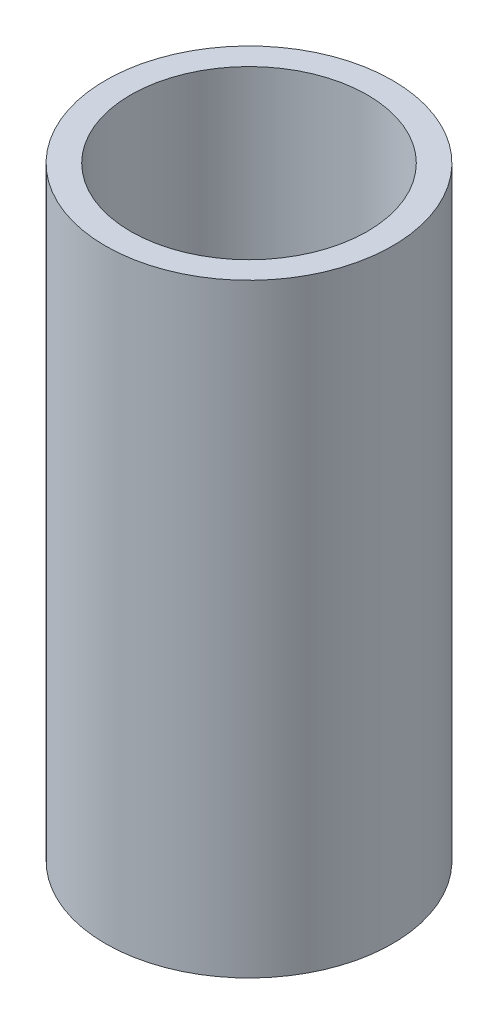
ISO-10303-21;
HEADER;
FILE_DESCRIPTION(('STEP AP214'),'2;1');
FILE_NAME('part.step','',(''),(''),'','','');
FILE_SCHEMA(('AUTOMOTIVE_DESIGN { 1 0 10303 214 1 1 1 1 }'));
ENDSEC;
DATA;
#1=APPLICATION_CONTEXT('core data for automotive mechanical design processes');
#2=APPLICATION_PROTOCOL_DEFINITION('international standard','automotive_design',2000,#1);
#3=PRODUCT_CONTEXT('',#1,'mechanical');
#4=PRODUCT('Part','Part','',(#3));
#5=PRODUCT_RELATED_PRODUCT_CATEGORY('part','',(#4));
#6=PRODUCT_DEFINITION_FORMATION('','',#4);
#7=PRODUCT_DEFINITION_CONTEXT('part definition',#1,'design');
#8=PRODUCT_DEFINITION('design','',#6,#7);
#9=PRODUCT_DEFINITION_SHAPE('','',#8);
#10=(LENGTH_UNIT() NAMED_UNIT(*) SI_UNIT(.MILLI.,.METRE.));
#11=(NAMED_UNIT(*) PLANE_ANGLE_UNIT() SI_UNIT($,.RADIAN.));
#12=(NAMED_UNIT(*) SI_UNIT($,.STERADIAN.) SOLID_ANGLE_UNIT());
#13=UNCERTAINTY_MEASURE_WITH_UNIT(LENGTH_MEASURE(1.E-05),#10,'distance_accuracy_value','');
#14=(GEOMETRIC_REPRESENTATION_CONTEXT(3) GLOBAL_UNCERTAINTY_ASSIGNED_CONTEXT((#13)) GLOBAL_UNIT_ASSIGNED_CONTEXT((#10,
#11,#12)) REPRESENTATION_CONTEXT('',''));
#15=CARTESIAN_POINT('',(0.,0.,0.));
#16=DIRECTION('',(0.,0.,1.));
#17=DIRECTION('',(1.,0.,0.));
#18=AXIS2_PLACEMENT_3D('',#15,#16,#17);
#19=CARTESIAN_POINT('',(0.,12.,0.));
#20=DIRECTION('',(0.,1.,0.));
#21=DIRECTION('',(0.,0.,1.));
#22=AXIS2_PLACEMENT_3D('',#19,#20,#21);
#23=PLANE('',#22);
#24=CARTESIAN_POINT('',(0.,12.,0.));
#25=DIRECTION('',(0.,1.,0.));
#26=DIRECTION('',(0.,0.,1.));
#27=AXIS2_PLACEMENT_3D('',#24,#25,#26);
#28=CIRCLE('',#27,2.85);
#29=CARTESIAN_POINT('',(0.,12.,2.85));
#30=VERTEX_POINT('',#29);
#31=EDGE_CURVE('E10',#30,#30,#28,.T.);
#32=ORIENTED_EDGE('',*,*,#31,.T.);
#33=EDGE_LOOP('',(#32));
#34=FACE_BOUND('',#33,.T.);
#35=CARTESIAN_POINT('',(0.,12.,0.));
#36=DIRECTION('',(0.,1.,0.));
#37=DIRECTION('',(0.,0.,1.));
#38=AXIS2_PLACEMENT_3D('',#35,#36,#37);
#39=CIRCLE('',#38,2.35);
#40=CARTESIAN_POINT('',(0.,12.,2.35));
#41=VERTEX_POINT('',#40);
#42=EDGE_CURVE('E43',#41,#41,#39,.T.);
#43=ORIENTED_EDGE('',*,*,#42,.F.);
#44=EDGE_LOOP('',(#43));
#45=FACE_BOUND('',#44,.T.);
#46=ADVANCED_FACE('F32',(#34,#45),#23,.T.);
#47=CARTESIAN_POINT('',(0.,0.,0.));
#48=DIRECTION('',(0.,1.,0.));
#49=DIRECTION('',(0.,0.,1.));
#50=AXIS2_PLACEMENT_3D('',#47,#48,#49);
#51=PLANE('',#50);
#52=CARTESIAN_POINT('',(0.,0.,0.));
#53=DIRECTION('',(0.,1.,0.));
#54=DIRECTION('',(0.,0.,1.));
#55=AXIS2_PLACEMENT_3D('',#52,#53,#54);
#56=CIRCLE('',#55,2.85);
#57=CARTESIAN_POINT('',(0.,0.,2.85));
#58=VERTEX_POINT('',#57);
#59=EDGE_CURVE('E36',#58,#58,#56,.T.);
#60=ORIENTED_EDGE('',*,*,#59,.F.);
#61=EDGE_LOOP('',(#60));
#62=FACE_BOUND('',#61,.T.);
#63=CARTESIAN_POINT('',(0.,0.,0.));
#64=DIRECTION('',(0.,1.,0.));
#65=DIRECTION('',(0.,0.,1.));
#66=AXIS2_PLACEMENT_3D('',#63,#64,#65);
#67=CIRCLE('',#66,2.35);
#68=CARTESIAN_POINT('',(0.,0.,2.35));
#69=VERTEX_POINT('',#68);
#70=EDGE_CURVE('E45',#69,#69,#67,.T.);
#71=ORIENTED_EDGE('',*,*,#70,.T.);
#72=EDGE_LOOP('',(#71));
#73=FACE_BOUND('',#72,.T.);
#74=ADVANCED_FACE('F55',(#62,#73),#51,.F.);
#75=CARTESIAN_POINT('',(0.,12.,0.));
#76=DIRECTION('',(0.,-1.,0.));
#77=DIRECTION('',(0.,0.,-1.));
#78=AXIS2_PLACEMENT_3D('',#75,#76,#77);
#79=CYLINDRICAL_SURFACE('',#78,2.85);
#80=ORIENTED_EDGE('',*,*,#31,.F.);
#81=EDGE_LOOP('',(#80));
#82=FACE_BOUND('',#81,.T.);
#83=ORIENTED_EDGE('',*,*,#59,.T.);
#84=EDGE_LOOP('',(#83));
#85=FACE_BOUND('',#84,.T.);
#86=ADVANCED_FACE('F34',(#82,#85),#79,.T.);
#87=CARTESIAN_POINT('',(0.,12.,0.));
#88=DIRECTION('',(0.,-1.,0.));
#89=DIRECTION('',(0.,0.,-1.));
#90=AXIS2_PLACEMENT_3D('',#87,#88,#89);
#91=CYLINDRICAL_SURFACE('',#90,2.35);
#92=ORIENTED_EDGE('',*,*,#42,.T.);
#93=EDGE_LOOP('',(#92));
#94=FACE_BOUND('',#93,.T.);
#95=ORIENTED_EDGE('',*,*,#70,.F.);
#96=EDGE_LOOP('',(#95));
#97=FACE_BOUND('',#96,.T.);
#98=ADVANCED_FACE('F51',(#94,#97),#91,.F.);
#99=CLOSED_SHELL('',(#46,#74,#86,#98));
#100=MANIFOLD_SOLID_BREP('B2',#99);
#101=ADVANCED_BREP_SHAPE_REPRESENTATION('',(#18,#100),#14);
#102=SHAPE_DEFINITION_REPRESENTATION(#9,#101);
ENDSEC;
END-ISO-10303-21;
